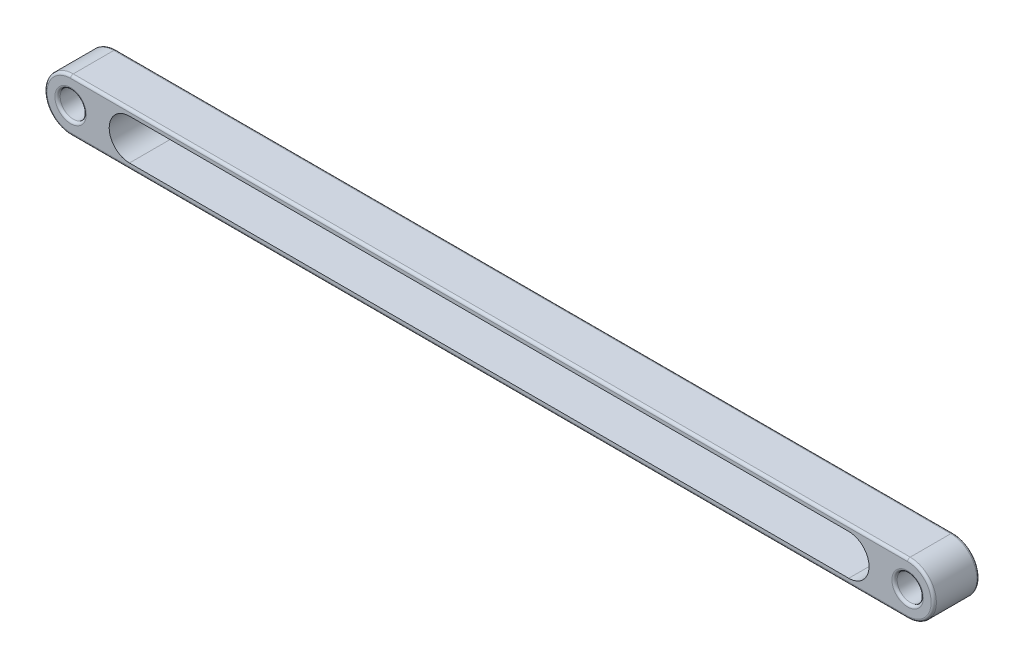
ISO-10303-21;
HEADER;
FILE_DESCRIPTION(('STEP AP214'),'2;1');
FILE_NAME('part.step','',(''),(''),'','','');
FILE_SCHEMA(('AUTOMOTIVE_DESIGN { 1 0 10303 214 1 1 1 1 }'));
ENDSEC;
DATA;
#1=APPLICATION_CONTEXT('core data for automotive mechanical design processes');
#2=APPLICATION_PROTOCOL_DEFINITION('international standard','automotive_design',2000,#1);
#3=PRODUCT_CONTEXT('',#1,'mechanical');
#4=PRODUCT('Part','Part','',(#3));
#5=PRODUCT_RELATED_PRODUCT_CATEGORY('part','',(#4));
#6=PRODUCT_DEFINITION_FORMATION('','',#4);
#7=PRODUCT_DEFINITION_CONTEXT('part definition',#1,'design');
#8=PRODUCT_DEFINITION('design','',#6,#7);
#9=PRODUCT_DEFINITION_SHAPE('','',#8);
#10=(LENGTH_UNIT() NAMED_UNIT(*) SI_UNIT(.MILLI.,.METRE.));
#11=(NAMED_UNIT(*) PLANE_ANGLE_UNIT() SI_UNIT($,.RADIAN.));
#12=(NAMED_UNIT(*) SI_UNIT($,.STERADIAN.) SOLID_ANGLE_UNIT());
#13=UNCERTAINTY_MEASURE_WITH_UNIT(LENGTH_MEASURE(1.E-05),#10,'distance_accuracy_value','');
#14=(GEOMETRIC_REPRESENTATION_CONTEXT(3) GLOBAL_UNCERTAINTY_ASSIGNED_CONTEXT((#13)) GLOBAL_UNIT_ASSIGNED_CONTEXT((#10,
#11,#12)) REPRESENTATION_CONTEXT('',''));
#15=CARTESIAN_POINT('',(0.,0.,0.));
#16=DIRECTION('',(0.,0.,1.));
#17=DIRECTION('',(1.,0.,0.));
#18=AXIS2_PLACEMENT_3D('',#15,#16,#17);
#19=CARTESIAN_POINT('',(-320.,0.,17.5));
#20=DIRECTION('',(0.,0.,-1.));
#21=DIRECTION('',(-1.,0.,0.));
#22=AXIS2_PLACEMENT_3D('',#19,#20,#21);
#23=CYLINDRICAL_SURFACE('',#22,20.);
#24=DIRECTION('',(0.,0.,-1.));
#25=VECTOR('',#24,1.);
#26=CARTESIAN_POINT('',(-320.,-20.,17.5));
#27=LINE('',#26,#25);
#28=CARTESIAN_POINT('',(-320.,-20.,15.5));
#29=VERTEX_POINT('',#28);
#30=CARTESIAN_POINT('',(-320.,-20.,-15.5));
#31=VERTEX_POINT('',#30);
#32=EDGE_CURVE('E176',#29,#31,#27,.T.);
#33=ORIENTED_EDGE('',*,*,#32,.F.);
#34=CARTESIAN_POINT('',(-320.,0.,15.5));
#35=DIRECTION('',(0.,0.,1.));
#36=DIRECTION('',(1.,0.,0.));
#37=AXIS2_PLACEMENT_3D('',#34,#35,#36);
#38=CIRCLE('',#37,20.);
#39=CARTESIAN_POINT('',(-320.,20.,15.5));
#40=VERTEX_POINT('',#39);
#41=EDGE_CURVE('E206',#29,#40,#38,.F.);
#42=ORIENTED_EDGE('',*,*,#41,.T.);
#43=DIRECTION('',(0.,0.,-1.));
#44=VECTOR('',#43,1.);
#45=CARTESIAN_POINT('',(-320.,20.,17.5));
#46=LINE('',#45,#44);
#47=CARTESIAN_POINT('',(-320.,20.,-15.5));
#48=VERTEX_POINT('',#47);
#49=EDGE_CURVE('E167',#40,#48,#46,.T.);
#50=ORIENTED_EDGE('',*,*,#49,.T.);
#51=CARTESIAN_POINT('',(-320.,0.,-15.5));
#52=DIRECTION('',(0.,0.,1.));
#53=DIRECTION('',(1.,0.,0.));
#54=AXIS2_PLACEMENT_3D('',#51,#52,#53);
#55=CIRCLE('',#54,20.);
#56=EDGE_CURVE('E204',#48,#31,#55,.T.);
#57=ORIENTED_EDGE('',*,*,#56,.T.);
#58=EDGE_LOOP('',(#33,#42,#50,#57));
#59=FACE_BOUND('',#58,.T.);
#60=ADVANCED_FACE('F33',(#59),#23,.T.);
#61=CARTESIAN_POINT('',(-320.,-20.,17.5));
#62=DIRECTION('',(0.,1.,0.));
#63=DIRECTION('',(0.,0.,1.));
#64=AXIS2_PLACEMENT_3D('',#61,#62,#63);
#65=PLANE('',#64);
#66=DIRECTION('',(0.,0.,-1.));
#67=VECTOR('',#66,1.);
#68=CARTESIAN_POINT('',(320.,-20.,17.5));
#69=LINE('',#68,#67);
#70=CARTESIAN_POINT('',(320.,-20.,15.5));
#71=VERTEX_POINT('',#70);
#72=CARTESIAN_POINT('',(320.,-20.,-15.5));
#73=VERTEX_POINT('',#72);
#74=EDGE_CURVE('E173',#71,#73,#69,.T.);
#75=ORIENTED_EDGE('',*,*,#74,.F.);
#76=DIRECTION('',(1.,0.,0.));
#77=VECTOR('',#76,1.);
#78=CARTESIAN_POINT('',(-320.,-20.,15.5));
#79=LINE('',#78,#77);
#80=EDGE_CURVE('E202',#71,#29,#79,.F.);
#81=ORIENTED_EDGE('',*,*,#80,.T.);
#82=ORIENTED_EDGE('',*,*,#32,.T.);
#83=DIRECTION('',(1.,0.,0.));
#84=VECTOR('',#83,1.);
#85=CARTESIAN_POINT('',(-320.,-20.,-15.5));
#86=LINE('',#85,#84);
#87=EDGE_CURVE('E200',#31,#73,#86,.T.);
#88=ORIENTED_EDGE('',*,*,#87,.T.);
#89=EDGE_LOOP('',(#75,#81,#82,#88));
#90=FACE_BOUND('',#89,.T.);
#91=ADVANCED_FACE('F283',(#90),#65,.F.);
#92=CARTESIAN_POINT('',(320.,0.,17.5));
#93=DIRECTION('',(0.,0.,-1.));
#94=DIRECTION('',(-1.,0.,0.));
#95=AXIS2_PLACEMENT_3D('',#92,#93,#94);
#96=CYLINDRICAL_SURFACE('',#95,20.);
#97=DIRECTION('',(0.,0.,-1.));
#98=VECTOR('',#97,1.);
#99=CARTESIAN_POINT('',(320.,20.,17.5));
#100=LINE('',#99,#98);
#101=CARTESIAN_POINT('',(320.,20.,15.5));
#102=VERTEX_POINT('',#101);
#103=CARTESIAN_POINT('',(320.,20.,-15.5));
#104=VERTEX_POINT('',#103);
#105=EDGE_CURVE('E170',#102,#104,#100,.T.);
#106=ORIENTED_EDGE('',*,*,#105,.F.);
#107=CARTESIAN_POINT('',(320.,0.,15.5));
#108=DIRECTION('',(0.,0.,1.));
#109=DIRECTION('',(1.,0.,0.));
#110=AXIS2_PLACEMENT_3D('',#107,#108,#109);
#111=CIRCLE('',#110,20.);
#112=EDGE_CURVE('E197',#102,#71,#111,.F.);
#113=ORIENTED_EDGE('',*,*,#112,.T.);
#114=ORIENTED_EDGE('',*,*,#74,.T.);
#115=CARTESIAN_POINT('',(320.,0.,-15.5));
#116=DIRECTION('',(0.,0.,1.));
#117=DIRECTION('',(1.,0.,0.));
#118=AXIS2_PLACEMENT_3D('',#115,#116,#117);
#119=CIRCLE('',#118,20.);
#120=EDGE_CURVE('E194',#73,#104,#119,.T.);
#121=ORIENTED_EDGE('',*,*,#120,.T.);
#122=EDGE_LOOP('',(#106,#113,#114,#121));
#123=FACE_BOUND('',#122,.T.);
#124=ADVANCED_FACE('F267',(#123),#96,.T.);
#125=CARTESIAN_POINT('',(-320.,20.,17.5));
#126=DIRECTION('',(0.,-1.,0.));
#127=DIRECTION('',(0.,0.,-1.));
#128=AXIS2_PLACEMENT_3D('',#125,#126,#127);
#129=PLANE('',#128);
#130=ORIENTED_EDGE('',*,*,#49,.F.);
#131=DIRECTION('',(-1.,0.,0.));
#132=VECTOR('',#131,1.);
#133=CARTESIAN_POINT('',(320.,20.,15.5));
#134=LINE('',#133,#132);
#135=EDGE_CURVE('E223',#40,#102,#134,.F.);
#136=ORIENTED_EDGE('',*,*,#135,.T.);
#137=ORIENTED_EDGE('',*,*,#105,.T.);
#138=DIRECTION('',(-1.,0.,0.));
#139=VECTOR('',#138,1.);
#140=CARTESIAN_POINT('',(-320.,20.,-15.5));
#141=LINE('',#140,#139);
#142=EDGE_CURVE('E221',#104,#48,#141,.T.);
#143=ORIENTED_EDGE('',*,*,#142,.T.);
#144=EDGE_LOOP('',(#130,#136,#137,#143));
#145=FACE_BOUND('',#144,.T.);
#146=ADVANCED_FACE('F270',(#145),#129,.F.);
#147=CARTESIAN_POINT('',(-320.,0.,17.5));
#148=DIRECTION('',(0.,0.,1.));
#149=DIRECTION('',(1.,0.,0.));
#150=AXIS2_PLACEMENT_3D('',#147,#148,#149);
#151=PLANE('',#150);
#152=DIRECTION('',(1.,0.,0.));
#153=VECTOR('',#152,1.);
#154=CARTESIAN_POINT('',(320.,-18.,17.5));
#155=LINE('',#154,#153);
#156=CARTESIAN_POINT('',(-320.,-18.,17.5));
#157=VERTEX_POINT('',#156);
#158=CARTESIAN_POINT('',(320.,-18.,17.5));
#159=VERTEX_POINT('',#158);
#160=EDGE_CURVE('E189',#157,#159,#155,.T.);
#161=ORIENTED_EDGE('',*,*,#160,.T.);
#162=CARTESIAN_POINT('',(320.,0.,17.5));
#163=DIRECTION('',(0.,0.,1.));
#164=DIRECTION('',(1.,0.,0.));
#165=AXIS2_PLACEMENT_3D('',#162,#163,#164);
#166=CIRCLE('',#165,18.);
#167=CARTESIAN_POINT('',(320.,18.,17.5));
#168=VERTEX_POINT('',#167);
#169=EDGE_CURVE('E191',#159,#168,#166,.T.);
#170=ORIENTED_EDGE('',*,*,#169,.T.);
#171=DIRECTION('',(-1.,0.,0.));
#172=VECTOR('',#171,1.);
#173=CARTESIAN_POINT('',(-320.,18.,17.5));
#174=LINE('',#173,#172);
#175=CARTESIAN_POINT('',(-320.,18.,17.5));
#176=VERTEX_POINT('',#175);
#177=EDGE_CURVE('E185',#168,#176,#174,.T.);
#178=ORIENTED_EDGE('',*,*,#177,.T.);
#179=CARTESIAN_POINT('',(-320.,0.,17.5));
#180=DIRECTION('',(0.,0.,1.));
#181=DIRECTION('',(1.,0.,0.));
#182=AXIS2_PLACEMENT_3D('',#179,#180,#181);
#183=CIRCLE('',#182,18.);
#184=EDGE_CURVE('E187',#176,#157,#183,.T.);
#185=ORIENTED_EDGE('',*,*,#184,.T.);
#186=EDGE_LOOP('',(#161,#170,#178,#185));
#187=FACE_BOUND('',#186,.T.);
#188=CARTESIAN_POINT('',(320.,0.,17.5));
#189=DIRECTION('',(0.,0.,1.));
#190=DIRECTION('',(1.,0.,0.));
#191=AXIS2_PLACEMENT_3D('',#188,#189,#190);
#192=CIRCLE('',#191,12.);
#193=CARTESIAN_POINT('',(332.,0.,17.5));
#194=VERTEX_POINT('',#193);
#195=EDGE_CURVE('E182',#194,#194,#192,.F.);
#196=ORIENTED_EDGE('',*,*,#195,.T.);
#197=EDGE_LOOP('',(#196));
#198=FACE_BOUND('',#197,.T.);
#199=CARTESIAN_POINT('',(-320.,0.,17.5));
#200=DIRECTION('',(0.,0.,1.));
#201=DIRECTION('',(1.,0.,0.));
#202=AXIS2_PLACEMENT_3D('',#199,#200,#201);
#203=CIRCLE('',#202,12.);
#204=CARTESIAN_POINT('',(-308.,0.,17.5));
#205=VERTEX_POINT('',#204);
#206=EDGE_CURVE('E179',#205,#205,#203,.F.);
#207=ORIENTED_EDGE('',*,*,#206,.T.);
#208=EDGE_LOOP('',(#207));
#209=FACE_BOUND('',#208,.T.);
#210=CARTESIAN_POINT('',(275.,0.,17.5));
#211=DIRECTION('',(0.,0.,1.));
#212=DIRECTION('',(1.,0.,0.));
#213=AXIS2_PLACEMENT_3D('',#210,#211,#212);
#214=CIRCLE('',#213,15.5);
#215=CARTESIAN_POINT('',(275.,-15.5,17.5));
#216=VERTEX_POINT('',#215);
#217=CARTESIAN_POINT('',(275.,15.5,17.5));
#218=VERTEX_POINT('',#217);
#219=EDGE_CURVE('E165',#216,#218,#214,.T.);
#220=ORIENTED_EDGE('',*,*,#219,.F.);
#221=DIRECTION('',(1.,0.,0.));
#222=VECTOR('',#221,1.);
#223=CARTESIAN_POINT('',(-320.,-15.5,17.5));
#224=LINE('',#223,#222);
#225=CARTESIAN_POINT('',(-275.,-15.5,17.5));
#226=VERTEX_POINT('',#225);
#227=EDGE_CURVE('E158',#226,#216,#224,.T.);
#228=ORIENTED_EDGE('',*,*,#227,.F.);
#229=CARTESIAN_POINT('',(-275.,0.,17.5));
#230=DIRECTION('',(0.,0.,1.));
#231=DIRECTION('',(1.,0.,0.));
#232=AXIS2_PLACEMENT_3D('',#229,#230,#231);
#233=CIRCLE('',#232,15.5);
#234=CARTESIAN_POINT('',(-275.,15.5,17.5));
#235=VERTEX_POINT('',#234);
#236=EDGE_CURVE('E134',#235,#226,#233,.T.);
#237=ORIENTED_EDGE('',*,*,#236,.F.);
#238=DIRECTION('',(-1.,0.,0.));
#239=VECTOR('',#238,1.);
#240=CARTESIAN_POINT('',(-320.,15.5,17.5));
#241=LINE('',#240,#239);
#242=EDGE_CURVE('E163',#218,#235,#241,.T.);
#243=ORIENTED_EDGE('',*,*,#242,.F.);
#244=EDGE_LOOP('',(#220,#228,#237,#243));
#245=FACE_BOUND('',#244,.T.);
#246=ADVANCED_FACE('F295',(#187,#198,#209,#245),#151,.T.);
#247=CARTESIAN_POINT('',(-320.,0.,-17.5));
#248=DIRECTION('',(0.,0.,1.));
#249=DIRECTION('',(1.,0.,0.));
#250=AXIS2_PLACEMENT_3D('',#247,#248,#249);
#251=PLANE('',#250);
#252=DIRECTION('',(-1.,0.,0.));
#253=VECTOR('',#252,1.);
#254=CARTESIAN_POINT('',(-320.,18.,-17.5));
#255=LINE('',#254,#253);
#256=CARTESIAN_POINT('',(-320.,18.,-17.5));
#257=VERTEX_POINT('',#256);
#258=CARTESIAN_POINT('',(320.,18.,-17.5));
#259=VERTEX_POINT('',#258);
#260=EDGE_CURVE('E214',#257,#259,#255,.F.);
#261=ORIENTED_EDGE('',*,*,#260,.T.);
#262=CARTESIAN_POINT('',(320.,0.,-17.5));
#263=DIRECTION('',(0.,0.,1.));
#264=DIRECTION('',(1.,0.,0.));
#265=AXIS2_PLACEMENT_3D('',#262,#263,#264);
#266=CIRCLE('',#265,18.);
#267=CARTESIAN_POINT('',(320.,-18.,-17.5));
#268=VERTEX_POINT('',#267);
#269=EDGE_CURVE('E219',#259,#268,#266,.F.);
#270=ORIENTED_EDGE('',*,*,#269,.T.);
#271=DIRECTION('',(1.,0.,0.));
#272=VECTOR('',#271,1.);
#273=CARTESIAN_POINT('',(-320.,-18.,-17.5));
#274=LINE('',#273,#272);
#275=CARTESIAN_POINT('',(-320.,-18.,-17.5));
#276=VERTEX_POINT('',#275);
#277=EDGE_CURVE('E57',#268,#276,#274,.F.);
#278=ORIENTED_EDGE('',*,*,#277,.T.);
#279=CARTESIAN_POINT('',(-320.,0.,-17.5));
#280=DIRECTION('',(0.,0.,1.));
#281=DIRECTION('',(1.,0.,0.));
#282=AXIS2_PLACEMENT_3D('',#279,#280,#281);
#283=CIRCLE('',#282,18.);
#284=EDGE_CURVE('E216',#276,#257,#283,.F.);
#285=ORIENTED_EDGE('',*,*,#284,.T.);
#286=EDGE_LOOP('',(#261,#270,#278,#285));
#287=FACE_BOUND('',#286,.T.);
#288=CARTESIAN_POINT('',(320.,0.,-17.5));
#289=DIRECTION('',(0.,0.,1.));
#290=DIRECTION('',(1.,0.,0.));
#291=AXIS2_PLACEMENT_3D('',#288,#289,#290);
#292=CIRCLE('',#291,12.);
#293=CARTESIAN_POINT('',(332.,0.,-17.5));
#294=VERTEX_POINT('',#293);
#295=EDGE_CURVE('E211',#294,#294,#292,.T.);
#296=ORIENTED_EDGE('',*,*,#295,.T.);
#297=EDGE_LOOP('',(#296));
#298=FACE_BOUND('',#297,.T.);
#299=CARTESIAN_POINT('',(-320.,0.,-17.5));
#300=DIRECTION('',(0.,0.,1.));
#301=DIRECTION('',(1.,0.,0.));
#302=AXIS2_PLACEMENT_3D('',#299,#300,#301);
#303=CIRCLE('',#302,12.);
#304=CARTESIAN_POINT('',(-308.,0.,-17.5));
#305=VERTEX_POINT('',#304);
#306=EDGE_CURVE('E208',#305,#305,#303,.T.);
#307=ORIENTED_EDGE('',*,*,#306,.T.);
#308=EDGE_LOOP('',(#307));
#309=FACE_BOUND('',#308,.T.);
#310=DIRECTION('',(-1.,0.,0.));
#311=VECTOR('',#310,1.);
#312=CARTESIAN_POINT('',(275.,-15.5,-17.5));
#313=LINE('',#312,#311);
#314=CARTESIAN_POINT('',(275.,-15.5,-17.5));
#315=VERTEX_POINT('',#314);
#316=CARTESIAN_POINT('',(-275.,-15.5,-17.5));
#317=VERTEX_POINT('',#316);
#318=EDGE_CURVE('E142',#315,#317,#313,.T.);
#319=ORIENTED_EDGE('',*,*,#318,.F.);
#320=CARTESIAN_POINT('',(275.,0.,-17.5));
#321=DIRECTION('',(0.,0.,-1.));
#322=DIRECTION('',(-1.,0.,0.));
#323=AXIS2_PLACEMENT_3D('',#320,#321,#322);
#324=CIRCLE('',#323,15.5);
#325=CARTESIAN_POINT('',(275.,15.5,-17.5));
#326=VERTEX_POINT('',#325);
#327=EDGE_CURVE('E147',#326,#315,#324,.T.);
#328=ORIENTED_EDGE('',*,*,#327,.F.);
#329=DIRECTION('',(1.,0.,0.));
#330=VECTOR('',#329,1.);
#331=CARTESIAN_POINT('',(275.,15.5,-17.5));
#332=LINE('',#331,#330);
#333=CARTESIAN_POINT('',(-275.,15.5,-17.5));
#334=VERTEX_POINT('',#333);
#335=EDGE_CURVE('E151',#334,#326,#332,.T.);
#336=ORIENTED_EDGE('',*,*,#335,.F.);
#337=CARTESIAN_POINT('',(-275.,0.,-17.5));
#338=DIRECTION('',(0.,0.,-1.));
#339=DIRECTION('',(-1.,0.,0.));
#340=AXIS2_PLACEMENT_3D('',#337,#338,#339);
#341=CIRCLE('',#340,15.5);
#342=EDGE_CURVE('E131',#317,#334,#341,.T.);
#343=ORIENTED_EDGE('',*,*,#342,.F.);
#344=EDGE_LOOP('',(#319,#328,#336,#343));
#345=FACE_BOUND('',#344,.T.);
#346=ADVANCED_FACE('F149',(#287,#298,#309,#345),#251,.F.);
#347=CARTESIAN_POINT('',(-320.,0.,-17.5));
#348=DIRECTION('',(0.,0.,1.));
#349=DIRECTION('',(1.,0.,0.));
#350=AXIS2_PLACEMENT_3D('',#347,#348,#349);
#351=CYLINDRICAL_SURFACE('',#350,10.);
#352=CARTESIAN_POINT('',(-320.,0.,15.5));
#353=DIRECTION('',(0.,0.,1.));
#354=DIRECTION('',(1.,0.,0.));
#355=AXIS2_PLACEMENT_3D('',#352,#353,#354);
#356=CIRCLE('',#355,10.);
#357=CARTESIAN_POINT('',(-310.,0.,15.5));
#358=VERTEX_POINT('',#357);
#359=EDGE_CURVE('E11',#358,#358,#356,.T.);
#360=ORIENTED_EDGE('',*,*,#359,.T.);
#361=EDGE_LOOP('',(#360));
#362=FACE_BOUND('',#361,.T.);
#363=CARTESIAN_POINT('',(-320.,0.,-15.5));
#364=DIRECTION('',(0.,0.,1.));
#365=DIRECTION('',(1.,0.,0.));
#366=AXIS2_PLACEMENT_3D('',#363,#364,#365);
#367=CIRCLE('',#366,10.);
#368=CARTESIAN_POINT('',(-310.,0.,-15.5));
#369=VERTEX_POINT('',#368);
#370=EDGE_CURVE('E42',#369,#369,#367,.F.);
#371=ORIENTED_EDGE('',*,*,#370,.T.);
#372=EDGE_LOOP('',(#371));
#373=FACE_BOUND('',#372,.T.);
#374=ADVANCED_FACE('F360',(#362,#373),#351,.F.);
#375=CARTESIAN_POINT('',(320.,0.,-17.5));
#376=DIRECTION('',(0.,0.,1.));
#377=DIRECTION('',(1.,0.,0.));
#378=AXIS2_PLACEMENT_3D('',#375,#376,#377);
#379=CYLINDRICAL_SURFACE('',#378,10.);
#380=CARTESIAN_POINT('',(320.,0.,15.5));
#381=DIRECTION('',(0.,0.,1.));
#382=DIRECTION('',(1.,0.,0.));
#383=AXIS2_PLACEMENT_3D('',#380,#381,#382);
#384=CIRCLE('',#383,10.);
#385=CARTESIAN_POINT('',(330.,0.,15.5));
#386=VERTEX_POINT('',#385);
#387=EDGE_CURVE('E228',#386,#386,#384,.T.);
#388=ORIENTED_EDGE('',*,*,#387,.T.);
#389=EDGE_LOOP('',(#388));
#390=FACE_BOUND('',#389,.T.);
#391=CARTESIAN_POINT('',(320.,0.,-15.5));
#392=DIRECTION('',(0.,0.,1.));
#393=DIRECTION('',(1.,0.,0.));
#394=AXIS2_PLACEMENT_3D('',#391,#392,#393);
#395=CIRCLE('',#394,10.);
#396=CARTESIAN_POINT('',(330.,0.,-15.5));
#397=VERTEX_POINT('',#396);
#398=EDGE_CURVE('E225',#397,#397,#395,.F.);
#399=ORIENTED_EDGE('',*,*,#398,.T.);
#400=EDGE_LOOP('',(#399));
#401=FACE_BOUND('',#400,.T.);
#402=ADVANCED_FACE('F317',(#390,#401),#379,.F.);
#403=CARTESIAN_POINT('',(275.,0.,22.5));
#404=DIRECTION('',(0.,0.,-1.));
#405=DIRECTION('',(-1.,0.,0.));
#406=AXIS2_PLACEMENT_3D('',#403,#404,#405);
#407=CYLINDRICAL_SURFACE('',#406,15.5);
#408=ORIENTED_EDGE('',*,*,#219,.T.);
#409=DIRECTION('',(0.,0.,-1.));
#410=VECTOR('',#409,1.);
#411=CARTESIAN_POINT('',(275.,15.5,22.5));
#412=LINE('',#411,#410);
#413=EDGE_CURVE('E156',#218,#326,#412,.T.);
#414=ORIENTED_EDGE('',*,*,#413,.T.);
#415=ORIENTED_EDGE('',*,*,#327,.T.);
#416=DIRECTION('',(0.,0.,-1.));
#417=VECTOR('',#416,1.);
#418=CARTESIAN_POINT('',(275.,-15.5,22.5));
#419=LINE('',#418,#417);
#420=EDGE_CURVE('E138',#216,#315,#419,.T.);
#421=ORIENTED_EDGE('',*,*,#420,.F.);
#422=EDGE_LOOP('',(#408,#414,#415,#421));
#423=FACE_BOUND('',#422,.T.);
#424=ADVANCED_FACE('F307',(#423),#407,.F.);
#425=CARTESIAN_POINT('',(275.,15.5,22.5));
#426=DIRECTION('',(0.,1.,0.));
#427=DIRECTION('',(0.,0.,1.));
#428=AXIS2_PLACEMENT_3D('',#425,#426,#427);
#429=PLANE('',#428);
#430=ORIENTED_EDGE('',*,*,#242,.T.);
#431=DIRECTION('',(0.,0.,-1.));
#432=VECTOR('',#431,1.);
#433=CARTESIAN_POINT('',(-275.,15.5,22.5));
#434=LINE('',#433,#432);
#435=EDGE_CURVE('E137',#235,#334,#434,.T.);
#436=ORIENTED_EDGE('',*,*,#435,.T.);
#437=ORIENTED_EDGE('',*,*,#335,.T.);
#438=ORIENTED_EDGE('',*,*,#413,.F.);
#439=EDGE_LOOP('',(#430,#436,#437,#438));
#440=FACE_BOUND('',#439,.T.);
#441=ADVANCED_FACE('F309',(#440),#429,.F.);
#442=CARTESIAN_POINT('',(-275.,0.,22.5));
#443=DIRECTION('',(0.,0.,-1.));
#444=DIRECTION('',(-1.,0.,0.));
#445=AXIS2_PLACEMENT_3D('',#442,#443,#444);
#446=CYLINDRICAL_SURFACE('',#445,15.5);
#447=ORIENTED_EDGE('',*,*,#236,.T.);
#448=DIRECTION('',(0.,0.,-1.));
#449=VECTOR('',#448,1.);
#450=CARTESIAN_POINT('',(-275.,-15.5,22.5));
#451=LINE('',#450,#449);
#452=EDGE_CURVE('E126',#226,#317,#451,.T.);
#453=ORIENTED_EDGE('',*,*,#452,.T.);
#454=ORIENTED_EDGE('',*,*,#342,.T.);
#455=ORIENTED_EDGE('',*,*,#435,.F.);
#456=EDGE_LOOP('',(#447,#453,#454,#455));
#457=FACE_BOUND('',#456,.T.);
#458=ADVANCED_FACE('F128',(#457),#446,.F.);
#459=CARTESIAN_POINT('',(275.,-15.5,22.5));
#460=DIRECTION('',(0.,-1.,0.));
#461=DIRECTION('',(0.,0.,-1.));
#462=AXIS2_PLACEMENT_3D('',#459,#460,#461);
#463=PLANE('',#462);
#464=ORIENTED_EDGE('',*,*,#227,.T.);
#465=ORIENTED_EDGE('',*,*,#420,.T.);
#466=ORIENTED_EDGE('',*,*,#318,.T.);
#467=ORIENTED_EDGE('',*,*,#452,.F.);
#468=EDGE_LOOP('',(#464,#465,#466,#467));
#469=FACE_BOUND('',#468,.T.);
#470=ADVANCED_FACE('F143',(#469),#463,.F.);
#471=CARTESIAN_POINT('',(-320.,0.,15.5));
#472=DIRECTION('',(0.,0.,1.));
#473=DIRECTION('',(1.,0.,0.));
#474=AXIS2_PLACEMENT_3D('',#471,#472,#473);
#475=TOROIDAL_SURFACE('',#474,18.,2.);
#476=CARTESIAN_POINT('',(-320.,18.,15.5));
#477=DIRECTION('',(1.,0.,0.));
#478=DIRECTION('',(0.,0.,-1.));
#479=AXIS2_PLACEMENT_3D('',#476,#477,#478);
#480=CIRCLE('',#479,2.);
#481=EDGE_CURVE('E237',#40,#176,#480,.T.);
#482=ORIENTED_EDGE('',*,*,#481,.F.);
#483=ORIENTED_EDGE('',*,*,#41,.F.);
#484=CARTESIAN_POINT('',(-320.,-18.,15.5));
#485=DIRECTION('',(1.,0.,0.));
#486=DIRECTION('',(0.,0.,-1.));
#487=AXIS2_PLACEMENT_3D('',#484,#485,#486);
#488=CIRCLE('',#487,2.);
#489=EDGE_CURVE('E240',#157,#29,#488,.T.);
#490=ORIENTED_EDGE('',*,*,#489,.F.);
#491=ORIENTED_EDGE('',*,*,#184,.F.);
#492=EDGE_LOOP('',(#482,#483,#490,#491));
#493=FACE_BOUND('',#492,.T.);
#494=ADVANCED_FACE('F289',(#493),#475,.T.);
#495=CARTESIAN_POINT('',(-320.,-18.,15.5));
#496=DIRECTION('',(-1.,0.,0.));
#497=DIRECTION('',(0.,0.,1.));
#498=AXIS2_PLACEMENT_3D('',#495,#496,#497);
#499=CYLINDRICAL_SURFACE('',#498,2.);
#500=ORIENTED_EDGE('',*,*,#489,.T.);
#501=ORIENTED_EDGE('',*,*,#80,.F.);
#502=CARTESIAN_POINT('',(320.,-18.,15.5));
#503=DIRECTION('',(1.,0.,0.));
#504=DIRECTION('',(0.,0.,-1.));
#505=AXIS2_PLACEMENT_3D('',#502,#503,#504);
#506=CIRCLE('',#505,2.);
#507=EDGE_CURVE('E235',#159,#71,#506,.T.);
#508=ORIENTED_EDGE('',*,*,#507,.F.);
#509=ORIENTED_EDGE('',*,*,#160,.F.);
#510=EDGE_LOOP('',(#500,#501,#508,#509));
#511=FACE_BOUND('',#510,.T.);
#512=ADVANCED_FACE('F293',(#511),#499,.T.);
#513=CARTESIAN_POINT('',(-320.,18.,15.5));
#514=DIRECTION('',(1.,0.,0.));
#515=DIRECTION('',(0.,0.,-1.));
#516=AXIS2_PLACEMENT_3D('',#513,#514,#515);
#517=CYLINDRICAL_SURFACE('',#516,2.);
#518=ORIENTED_EDGE('',*,*,#481,.T.);
#519=ORIENTED_EDGE('',*,*,#177,.F.);
#520=CARTESIAN_POINT('',(320.,18.,15.5));
#521=DIRECTION('',(1.,0.,0.));
#522=DIRECTION('',(0.,0.,-1.));
#523=AXIS2_PLACEMENT_3D('',#520,#521,#522);
#524=CIRCLE('',#523,2.);
#525=EDGE_CURVE('E233',#102,#168,#524,.T.);
#526=ORIENTED_EDGE('',*,*,#525,.F.);
#527=ORIENTED_EDGE('',*,*,#135,.F.);
#528=EDGE_LOOP('',(#518,#519,#526,#527));
#529=FACE_BOUND('',#528,.T.);
#530=ADVANCED_FACE('F275',(#529),#517,.T.);
#531=CARTESIAN_POINT('',(320.,0.,15.5));
#532=DIRECTION('',(0.,0.,1.));
#533=DIRECTION('',(1.,0.,0.));
#534=AXIS2_PLACEMENT_3D('',#531,#532,#533);
#535=TOROIDAL_SURFACE('',#534,18.,2.);
#536=ORIENTED_EDGE('',*,*,#507,.T.);
#537=ORIENTED_EDGE('',*,*,#112,.F.);
#538=ORIENTED_EDGE('',*,*,#525,.T.);
#539=ORIENTED_EDGE('',*,*,#169,.F.);
#540=EDGE_LOOP('',(#536,#537,#538,#539));
#541=FACE_BOUND('',#540,.T.);
#542=ADVANCED_FACE('F279',(#541),#535,.T.);
#543=CARTESIAN_POINT('',(-320.,0.,-15.5));
#544=DIRECTION('',(0.,0.,1.));
#545=DIRECTION('',(1.,0.,0.));
#546=AXIS2_PLACEMENT_3D('',#543,#544,#545);
#547=TOROIDAL_SURFACE('',#546,18.,2.);
#548=CARTESIAN_POINT('',(-320.,18.,-15.5));
#549=DIRECTION('',(1.,0.,0.));
#550=DIRECTION('',(0.,0.,-1.));
#551=AXIS2_PLACEMENT_3D('',#548,#549,#550);
#552=CIRCLE('',#551,2.);
#553=EDGE_CURVE('E245',#257,#48,#552,.T.);
#554=ORIENTED_EDGE('',*,*,#553,.F.);
#555=ORIENTED_EDGE('',*,*,#284,.F.);
#556=CARTESIAN_POINT('',(-320.,-18.,-15.5));
#557=DIRECTION('',(1.,0.,0.));
#558=DIRECTION('',(0.,0.,-1.));
#559=AXIS2_PLACEMENT_3D('',#556,#557,#558);
#560=CIRCLE('',#559,2.);
#561=EDGE_CURVE('E37',#31,#276,#560,.T.);
#562=ORIENTED_EDGE('',*,*,#561,.F.);
#563=ORIENTED_EDGE('',*,*,#56,.F.);
#564=EDGE_LOOP('',(#554,#555,#562,#563));
#565=FACE_BOUND('',#564,.T.);
#566=ADVANCED_FACE('F258',(#565),#547,.T.);
#567=CARTESIAN_POINT('',(-320.,-18.,-15.5));
#568=DIRECTION('',(1.,0.,0.));
#569=DIRECTION('',(0.,0.,-1.));
#570=AXIS2_PLACEMENT_3D('',#567,#568,#569);
#571=CYLINDRICAL_SURFACE('',#570,2.);
#572=ORIENTED_EDGE('',*,*,#561,.T.);
#573=ORIENTED_EDGE('',*,*,#277,.F.);
#574=CARTESIAN_POINT('',(320.,-18.,-15.5));
#575=DIRECTION('',(1.,0.,0.));
#576=DIRECTION('',(0.,0.,-1.));
#577=AXIS2_PLACEMENT_3D('',#574,#575,#576);
#578=CIRCLE('',#577,2.);
#579=EDGE_CURVE('E50',#73,#268,#578,.T.);
#580=ORIENTED_EDGE('',*,*,#579,.F.);
#581=ORIENTED_EDGE('',*,*,#87,.F.);
#582=EDGE_LOOP('',(#572,#573,#580,#581));
#583=FACE_BOUND('',#582,.T.);
#584=ADVANCED_FACE('F255',(#583),#571,.T.);
#585=CARTESIAN_POINT('',(-320.,18.,-15.5));
#586=DIRECTION('',(-1.,0.,0.));
#587=DIRECTION('',(0.,0.,1.));
#588=AXIS2_PLACEMENT_3D('',#585,#586,#587);
#589=CYLINDRICAL_SURFACE('',#588,2.);
#590=ORIENTED_EDGE('',*,*,#553,.T.);
#591=ORIENTED_EDGE('',*,*,#142,.F.);
#592=CARTESIAN_POINT('',(320.,18.,-15.5));
#593=DIRECTION('',(1.,0.,0.));
#594=DIRECTION('',(0.,0.,-1.));
#595=AXIS2_PLACEMENT_3D('',#592,#593,#594);
#596=CIRCLE('',#595,2.);
#597=EDGE_CURVE('E243',#259,#104,#596,.T.);
#598=ORIENTED_EDGE('',*,*,#597,.F.);
#599=ORIENTED_EDGE('',*,*,#260,.F.);
#600=EDGE_LOOP('',(#590,#591,#598,#599));
#601=FACE_BOUND('',#600,.T.);
#602=ADVANCED_FACE('F262',(#601),#589,.T.);
#603=CARTESIAN_POINT('',(320.,0.,-15.5));
#604=DIRECTION('',(0.,0.,1.));
#605=DIRECTION('',(1.,0.,0.));
#606=AXIS2_PLACEMENT_3D('',#603,#604,#605);
#607=TOROIDAL_SURFACE('',#606,18.,2.);
#608=ORIENTED_EDGE('',*,*,#579,.T.);
#609=ORIENTED_EDGE('',*,*,#269,.F.);
#610=ORIENTED_EDGE('',*,*,#597,.T.);
#611=ORIENTED_EDGE('',*,*,#120,.F.);
#612=EDGE_LOOP('',(#608,#609,#610,#611));
#613=FACE_BOUND('',#612,.T.);
#614=ADVANCED_FACE('F261',(#613),#607,.T.);
#615=CARTESIAN_POINT('',(320.,0.,15.5));
#616=DIRECTION('',(0.,0.,1.));
#617=DIRECTION('',(1.,0.,0.));
#618=AXIS2_PLACEMENT_3D('',#615,#616,#617);
#619=TOROIDAL_SURFACE('',#618,12.,2.);
#620=ORIENTED_EDGE('',*,*,#195,.F.);
#621=EDGE_LOOP('',(#620));
#622=FACE_BOUND('',#621,.T.);
#623=ORIENTED_EDGE('',*,*,#387,.F.);
#624=EDGE_LOOP('',(#623));
#625=FACE_BOUND('',#624,.T.);
#626=ADVANCED_FACE('F337',(#622,#625),#619,.T.);
#627=CARTESIAN_POINT('',(320.,0.,-15.5));
#628=DIRECTION('',(0.,0.,1.));
#629=DIRECTION('',(1.,0.,0.));
#630=AXIS2_PLACEMENT_3D('',#627,#628,#629);
#631=TOROIDAL_SURFACE('',#630,12.,2.);
#632=ORIENTED_EDGE('',*,*,#398,.F.);
#633=EDGE_LOOP('',(#632));
#634=FACE_BOUND('',#633,.T.);
#635=ORIENTED_EDGE('',*,*,#295,.F.);
#636=EDGE_LOOP('',(#635));
#637=FACE_BOUND('',#636,.T.);
#638=ADVANCED_FACE('F346',(#634,#637),#631,.T.);
#639=CARTESIAN_POINT('',(-320.,0.,15.5));
#640=DIRECTION('',(0.,0.,1.));
#641=DIRECTION('',(1.,0.,0.));
#642=AXIS2_PLACEMENT_3D('',#639,#640,#641);
#643=TOROIDAL_SURFACE('',#642,12.,2.);
#644=ORIENTED_EDGE('',*,*,#206,.F.);
#645=EDGE_LOOP('',(#644));
#646=FACE_BOUND('',#645,.T.);
#647=ORIENTED_EDGE('',*,*,#359,.F.);
#648=EDGE_LOOP('',(#647));
#649=FACE_BOUND('',#648,.T.);
#650=ADVANCED_FACE('F349',(#646,#649),#643,.T.);
#651=CARTESIAN_POINT('',(-320.,0.,-15.5));
#652=DIRECTION('',(0.,0.,1.));
#653=DIRECTION('',(1.,0.,0.));
#654=AXIS2_PLACEMENT_3D('',#651,#652,#653);
#655=TOROIDAL_SURFACE('',#654,12.,2.);
#656=ORIENTED_EDGE('',*,*,#370,.F.);
#657=EDGE_LOOP('',(#656));
#658=FACE_BOUND('',#657,.T.);
#659=ORIENTED_EDGE('',*,*,#306,.F.);
#660=EDGE_LOOP('',(#659));
#661=FACE_BOUND('',#660,.T.);
#662=ADVANCED_FACE('F35',(#658,#661),#655,.T.);
#663=CLOSED_SHELL('',(#60,#91,#124,#146,#246,#346,#374,#402,#424,#441,#458,#470,#494,#512,#530,
#542,#566,#584,#602,#614,#626,#638,#650,#662));
#664=MANIFOLD_SOLID_BREP('B2',#663);
#665=ADVANCED_BREP_SHAPE_REPRESENTATION('',(#18,#664),#14);
#666=SHAPE_DEFINITION_REPRESENTATION(#9,#665);
ENDSEC;
END-ISO-10303-21;
